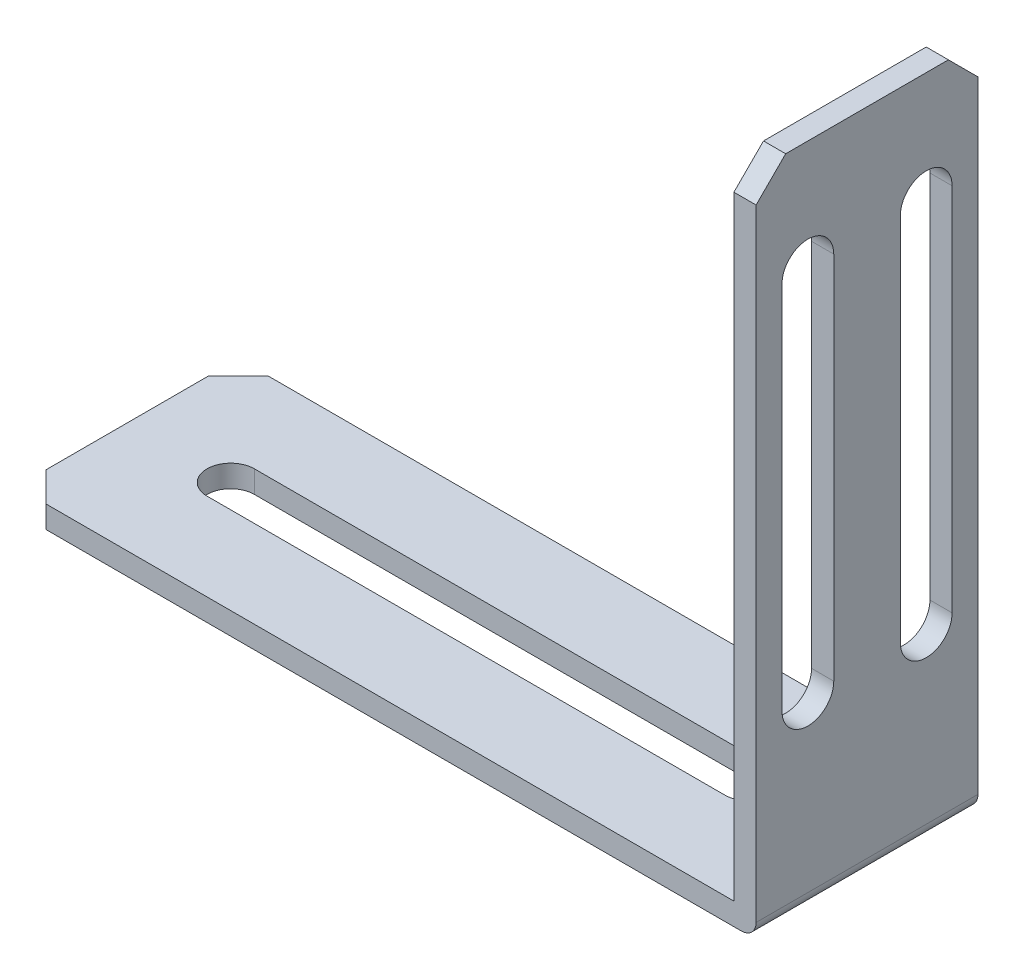
ISO-10303-21;
HEADER;
FILE_DESCRIPTION(('STEP AP214'),'2;1');
FILE_NAME('part.step','',(''),(''),'','','');
FILE_SCHEMA(('AUTOMOTIVE_DESIGN { 1 0 10303 214 1 1 1 1 }'));
ENDSEC;
DATA;
#1=APPLICATION_CONTEXT('core data for automotive mechanical design processes');
#2=APPLICATION_PROTOCOL_DEFINITION('international standard','automotive_design',2000,#1);
#3=PRODUCT_CONTEXT('',#1,'mechanical');
#4=PRODUCT('Part','Part','',(#3));
#5=PRODUCT_RELATED_PRODUCT_CATEGORY('part','',(#4));
#6=PRODUCT_DEFINITION_FORMATION('','',#4);
#7=PRODUCT_DEFINITION_CONTEXT('part definition',#1,'design');
#8=PRODUCT_DEFINITION('design','',#6,#7);
#9=PRODUCT_DEFINITION_SHAPE('','',#8);
#10=(LENGTH_UNIT() NAMED_UNIT(*) SI_UNIT(.MILLI.,.METRE.));
#11=(NAMED_UNIT(*) PLANE_ANGLE_UNIT() SI_UNIT($,.RADIAN.));
#12=(NAMED_UNIT(*) SI_UNIT($,.STERADIAN.) SOLID_ANGLE_UNIT());
#13=UNCERTAINTY_MEASURE_WITH_UNIT(LENGTH_MEASURE(1.E-05),#10,'distance_accuracy_value','');
#14=(GEOMETRIC_REPRESENTATION_CONTEXT(3) GLOBAL_UNCERTAINTY_ASSIGNED_CONTEXT((#13)) GLOBAL_UNIT_ASSIGNED_CONTEXT((#10,
#11,#12)) REPRESENTATION_CONTEXT('',''));
#15=CARTESIAN_POINT('',(0.,0.,0.));
#16=DIRECTION('',(0.,0.,1.));
#17=DIRECTION('',(1.,0.,0.));
#18=AXIS2_PLACEMENT_3D('',#15,#16,#17);
#19=CARTESIAN_POINT('',(-218.840579710145,-1.5,15.));
#20=DIRECTION('',(1.,0.,0.));
#21=DIRECTION('',(0.,0.,-1.));
#22=AXIS2_PLACEMENT_3D('',#19,#20,#21);
#23=PLANE('',#22);
#24=DIRECTION('',(0.,0.,-1.));
#25=VECTOR('',#24,1.);
#26=CARTESIAN_POINT('',(-218.840579710145,-1.5,15.));
#27=LINE('',#26,#25);
#28=CARTESIAN_POINT('',(-218.840579710145,-1.5,13.));
#29=VERTEX_POINT('',#28);
#30=CARTESIAN_POINT('',(-218.840579710145,-1.5,2.00000000000002));
#31=VERTEX_POINT('',#30);
#32=EDGE_CURVE('E325',#29,#31,#27,.T.);
#33=ORIENTED_EDGE('',*,*,#32,.F.);
#34=DIRECTION('',(0.,1.,0.));
#35=VECTOR('',#34,1.);
#36=CARTESIAN_POINT('',(-218.840579710145,-1.5,13.));
#37=LINE('',#36,#35);
#38=CARTESIAN_POINT('',(-218.840579710145,0.,13.));
#39=VERTEX_POINT('',#38);
#40=EDGE_CURVE('E360',#29,#39,#37,.T.);
#41=ORIENTED_EDGE('',*,*,#40,.T.);
#42=DIRECTION('',(0.,0.,-1.));
#43=VECTOR('',#42,1.);
#44=CARTESIAN_POINT('',(-218.840579710145,0.,15.));
#45=LINE('',#44,#43);
#46=CARTESIAN_POINT('',(-218.840579710145,0.,2.00000000000002));
#47=VERTEX_POINT('',#46);
#48=EDGE_CURVE('E306',#39,#47,#45,.T.);
#49=ORIENTED_EDGE('',*,*,#48,.T.);
#50=DIRECTION('',(0.,-1.,0.));
#51=VECTOR('',#50,1.);
#52=CARTESIAN_POINT('',(-218.840579710145,-1.5,2.00000000000002));
#53=LINE('',#52,#51);
#54=EDGE_CURVE('E357',#47,#31,#53,.T.);
#55=ORIENTED_EDGE('',*,*,#54,.T.);
#56=EDGE_LOOP('',(#33,#41,#49,#55));
#57=FACE_BOUND('',#56,.T.);
#58=ADVANCED_FACE('F33',(#57),#23,.F.);
#59=CARTESIAN_POINT('',(-168.840579710145,-1.49999999999999,15.));
#60=DIRECTION('',(0.,1.,0.));
#61=DIRECTION('',(-1.,0.,0.));
#62=AXIS2_PLACEMENT_3D('',#59,#60,#61);
#63=PLANE('',#62);
#64=DIRECTION('',(-1.,0.,0.));
#65=VECTOR('',#64,1.);
#66=CARTESIAN_POINT('',(-176.854809789273,-1.5,5.89999999999999));
#67=LINE('',#66,#65);
#68=CARTESIAN_POINT('',(-176.854809789273,-1.5,5.89999999999999));
#69=VERTEX_POINT('',#68);
#70=CARTESIAN_POINT('',(-211.854809789273,-1.5,5.9));
#71=VERTEX_POINT('',#70);
#72=EDGE_CURVE('E274',#69,#71,#67,.T.);
#73=ORIENTED_EDGE('',*,*,#72,.T.);
#74=CARTESIAN_POINT('',(-211.854809789273,-1.5,7.5));
#75=DIRECTION('',(0.,1.,0.));
#76=DIRECTION('',(0.,0.,1.));
#77=AXIS2_PLACEMENT_3D('',#74,#75,#76);
#78=CIRCLE('',#77,1.6);
#79=CARTESIAN_POINT('',(-211.854809789273,-1.5,9.1));
#80=VERTEX_POINT('',#79);
#81=EDGE_CURVE('E264',#71,#80,#78,.T.);
#82=ORIENTED_EDGE('',*,*,#81,.T.);
#83=DIRECTION('',(1.,0.,0.));
#84=VECTOR('',#83,1.);
#85=CARTESIAN_POINT('',(-176.854809789273,-1.5,9.1));
#86=LINE('',#85,#84);
#87=CARTESIAN_POINT('',(-176.854809789273,-1.5,9.1));
#88=VERTEX_POINT('',#87);
#89=EDGE_CURVE('E267',#80,#88,#86,.T.);
#90=ORIENTED_EDGE('',*,*,#89,.T.);
#91=CARTESIAN_POINT('',(-176.854809789273,-1.5,7.5));
#92=DIRECTION('',(0.,1.,0.));
#93=DIRECTION('',(0.,0.,1.));
#94=AXIS2_PLACEMENT_3D('',#91,#92,#93);
#95=CIRCLE('',#94,1.6);
#96=EDGE_CURVE('E271',#88,#69,#95,.T.);
#97=ORIENTED_EDGE('',*,*,#96,.T.);
#98=EDGE_LOOP('',(#73,#82,#90,#97));
#99=FACE_BOUND('',#98,.T.);
#100=DIRECTION('',(1.,0.,0.));
#101=VECTOR('',#100,1.);
#102=CARTESIAN_POINT('',(-168.840579710145,-1.49999999999999,0.));
#103=LINE('',#102,#101);
#104=CARTESIAN_POINT('',(-216.840579710145,-1.5,0.));
#105=VERTEX_POINT('',#104);
#106=CARTESIAN_POINT('',(-169.840579710145,-1.49999999999999,0.));
#107=VERTEX_POINT('',#106);
#108=EDGE_CURVE('E289',#105,#107,#103,.T.);
#109=ORIENTED_EDGE('',*,*,#108,.T.);
#110=DIRECTION('',(0.,0.,-1.));
#111=VECTOR('',#110,1.);
#112=CARTESIAN_POINT('',(-169.840579710145,-1.49999999999999,15.));
#113=LINE('',#112,#111);
#114=CARTESIAN_POINT('',(-169.840579710145,-1.49999999999999,15.));
#115=VERTEX_POINT('',#114);
#116=EDGE_CURVE('E41',#107,#115,#113,.F.);
#117=ORIENTED_EDGE('',*,*,#116,.T.);
#118=DIRECTION('',(1.,0.,0.));
#119=VECTOR('',#118,1.);
#120=CARTESIAN_POINT('',(-168.840579710145,-1.49999999999999,15.));
#121=LINE('',#120,#119);
#122=CARTESIAN_POINT('',(-216.840579710145,-1.5,15.));
#123=VERTEX_POINT('',#122);
#124=EDGE_CURVE('E296',#123,#115,#121,.T.);
#125=ORIENTED_EDGE('',*,*,#124,.F.);
#126=DIRECTION('',(0.70710678118655,0.,0.707106781186545));
#127=VECTOR('',#126,1.);
#128=CARTESIAN_POINT('',(-216.840579710145,-1.5,15.));
#129=LINE('',#128,#127);
#130=EDGE_CURVE('E355',#123,#29,#129,.F.);
#131=ORIENTED_EDGE('',*,*,#130,.T.);
#132=ORIENTED_EDGE('',*,*,#32,.T.);
#133=DIRECTION('',(0.707106781186549,0.,-0.707106781186546));
#134=VECTOR('',#133,1.);
#135=CARTESIAN_POINT('',(-218.840579710145,-1.5,2.00000000000002));
#136=LINE('',#135,#134);
#137=EDGE_CURVE('E353',#31,#105,#136,.T.);
#138=ORIENTED_EDGE('',*,*,#137,.T.);
#139=EDGE_LOOP('',(#109,#117,#125,#131,#132,#138));
#140=FACE_BOUND('',#139,.T.);
#141=ADVANCED_FACE('F407',(#99,#140),#63,.F.);
#142=CARTESIAN_POINT('',(-168.840579710145,43.5,15.));
#143=DIRECTION('',(-1.,0.,0.));
#144=DIRECTION('',(0.,-1.,0.));
#145=AXIS2_PLACEMENT_3D('',#142,#143,#144);
#146=PLANE('',#145);
#147=DIRECTION('',(0.,-1.,0.));
#148=VECTOR('',#147,1.);
#149=CARTESIAN_POINT('',(-168.840579710145,36.,9.75));
#150=LINE('',#149,#148);
#151=CARTESIAN_POINT('',(-168.840579710145,36.,9.75000000000003));
#152=VERTEX_POINT('',#151);
#153=CARTESIAN_POINT('',(-168.840579710145,11.,9.74999999999999));
#154=VERTEX_POINT('',#153);
#155=EDGE_CURVE('E200',#152,#154,#150,.T.);
#156=ORIENTED_EDGE('',*,*,#155,.T.);
#157=CARTESIAN_POINT('',(-168.840579710145,11.,11.5));
#158=DIRECTION('',(-1.,0.,0.));
#159=DIRECTION('',(0.,-1.,0.));
#160=AXIS2_PLACEMENT_3D('',#157,#158,#159);
#161=CIRCLE('',#160,1.75);
#162=CARTESIAN_POINT('',(-168.840579710145,11.,13.25));
#163=VERTEX_POINT('',#162);
#164=EDGE_CURVE('E192',#154,#163,#161,.T.);
#165=ORIENTED_EDGE('',*,*,#164,.T.);
#166=DIRECTION('',(0.,1.,0.));
#167=VECTOR('',#166,1.);
#168=CARTESIAN_POINT('',(-168.840579710145,36.,13.2499999999999));
#169=LINE('',#168,#167);
#170=CARTESIAN_POINT('',(-168.840579710145,36.,13.2499999999999));
#171=VERTEX_POINT('',#170);
#172=EDGE_CURVE('E204',#163,#171,#169,.T.);
#173=ORIENTED_EDGE('',*,*,#172,.T.);
#174=CARTESIAN_POINT('',(-168.840579710145,36.,11.5));
#175=DIRECTION('',(-1.,0.,0.));
#176=DIRECTION('',(0.,-1.,0.));
#177=AXIS2_PLACEMENT_3D('',#174,#175,#176);
#178=CIRCLE('',#177,1.74999999999997);
#179=EDGE_CURVE('E208',#171,#152,#178,.T.);
#180=ORIENTED_EDGE('',*,*,#179,.T.);
#181=EDGE_LOOP('',(#156,#165,#173,#180));
#182=FACE_BOUND('',#181,.T.);
#183=DIRECTION('',(0.,-1.,0.));
#184=VECTOR('',#183,1.);
#185=CARTESIAN_POINT('',(-168.840579710145,36.,1.75));
#186=LINE('',#185,#184);
#187=CARTESIAN_POINT('',(-168.840579710145,36.,1.75));
#188=VERTEX_POINT('',#187);
#189=CARTESIAN_POINT('',(-168.840579710145,11.,1.75));
#190=VERTEX_POINT('',#189);
#191=EDGE_CURVE('E242',#188,#190,#186,.T.);
#192=ORIENTED_EDGE('',*,*,#191,.T.);
#193=CARTESIAN_POINT('',(-168.840579710145,11.,3.5));
#194=DIRECTION('',(-1.,0.,0.));
#195=DIRECTION('',(0.,-1.,0.));
#196=AXIS2_PLACEMENT_3D('',#193,#194,#195);
#197=CIRCLE('',#196,1.75);
#198=CARTESIAN_POINT('',(-168.840579710145,11.,5.25000000000001));
#199=VERTEX_POINT('',#198);
#200=EDGE_CURVE('E232',#190,#199,#197,.T.);
#201=ORIENTED_EDGE('',*,*,#200,.T.);
#202=DIRECTION('',(0.,1.,0.));
#203=VECTOR('',#202,1.);
#204=CARTESIAN_POINT('',(-168.840579710145,36.,5.25));
#205=LINE('',#204,#203);
#206=CARTESIAN_POINT('',(-168.840579710145,36.,5.25));
#207=VERTEX_POINT('',#206);
#208=EDGE_CURVE('E235',#199,#207,#205,.T.);
#209=ORIENTED_EDGE('',*,*,#208,.T.);
#210=CARTESIAN_POINT('',(-168.840579710145,36.,3.5));
#211=DIRECTION('',(-1.,0.,0.));
#212=DIRECTION('',(0.,-1.,0.));
#213=AXIS2_PLACEMENT_3D('',#210,#211,#212);
#214=CIRCLE('',#213,1.75);
#215=EDGE_CURVE('E239',#207,#188,#214,.T.);
#216=ORIENTED_EDGE('',*,*,#215,.T.);
#217=EDGE_LOOP('',(#192,#201,#209,#216));
#218=FACE_BOUND('',#217,.T.);
#219=DIRECTION('',(0.,1.,0.));
#220=VECTOR('',#219,1.);
#221=CARTESIAN_POINT('',(-168.840579710145,43.5,15.));
#222=LINE('',#221,#220);
#223=CARTESIAN_POINT('',(-168.840579710145,-0.49999999999998,15.));
#224=VERTEX_POINT('',#223);
#225=CARTESIAN_POINT('',(-168.840579710145,41.5,15.));
#226=VERTEX_POINT('',#225);
#227=EDGE_CURVE('E298',#224,#226,#222,.T.);
#228=ORIENTED_EDGE('',*,*,#227,.F.);
#229=DIRECTION('',(0.,0.,-1.));
#230=VECTOR('',#229,1.);
#231=CARTESIAN_POINT('',(-168.840579710145,-0.499999999999994,15.));
#232=LINE('',#231,#230);
#233=CARTESIAN_POINT('',(-168.840579710145,-0.49999999999998,0.));
#234=VERTEX_POINT('',#233);
#235=EDGE_CURVE('E366',#224,#234,#232,.T.);
#236=ORIENTED_EDGE('',*,*,#235,.T.);
#237=DIRECTION('',(0.,1.,0.));
#238=VECTOR('',#237,1.);
#239=CARTESIAN_POINT('',(-168.840579710145,43.5,0.));
#240=LINE('',#239,#238);
#241=CARTESIAN_POINT('',(-168.840579710145,41.5,0.));
#242=VERTEX_POINT('',#241);
#243=EDGE_CURVE('E308',#234,#242,#240,.T.);
#244=ORIENTED_EDGE('',*,*,#243,.T.);
#245=DIRECTION('',(0.,0.707106781186549,0.707106781186546));
#246=VECTOR('',#245,1.);
#247=CARTESIAN_POINT('',(-168.840579710145,43.5,2.00000000000001));
#248=LINE('',#247,#246);
#249=CARTESIAN_POINT('',(-168.840579710145,43.5,2.00000000000001));
#250=VERTEX_POINT('',#249);
#251=EDGE_CURVE('E345',#242,#250,#248,.T.);
#252=ORIENTED_EDGE('',*,*,#251,.T.);
#253=DIRECTION('',(0.,0.,-1.));
#254=VECTOR('',#253,1.);
#255=CARTESIAN_POINT('',(-168.840579710145,43.5,15.));
#256=LINE('',#255,#254);
#257=CARTESIAN_POINT('',(-168.840579710145,43.5,13.));
#258=VERTEX_POINT('',#257);
#259=EDGE_CURVE('E322',#258,#250,#256,.T.);
#260=ORIENTED_EDGE('',*,*,#259,.F.);
#261=DIRECTION('',(0.,0.707106781186546,-0.707106781186549));
#262=VECTOR('',#261,1.);
#263=CARTESIAN_POINT('',(-168.840579710145,41.4999999999999,15.0000000000001));
#264=LINE('',#263,#262);
#265=EDGE_CURVE('E342',#258,#226,#264,.F.);
#266=ORIENTED_EDGE('',*,*,#265,.T.);
#267=EDGE_LOOP('',(#228,#236,#244,#252,#260,#266));
#268=FACE_BOUND('',#267,.T.);
#269=ADVANCED_FACE('F210',(#182,#218,#268),#146,.F.);
#270=CARTESIAN_POINT('',(-170.340579710145,43.5,15.));
#271=DIRECTION('',(0.,-1.,0.));
#272=DIRECTION('',(0.,0.,-1.));
#273=AXIS2_PLACEMENT_3D('',#270,#271,#272);
#274=PLANE('',#273);
#275=ORIENTED_EDGE('',*,*,#259,.T.);
#276=DIRECTION('',(-1.,0.,0.));
#277=VECTOR('',#276,1.);
#278=CARTESIAN_POINT('',(-170.340579710145,43.5,2.00000000000001));
#279=LINE('',#278,#277);
#280=CARTESIAN_POINT('',(-170.340579710145,43.5,2.00000000000001));
#281=VERTEX_POINT('',#280);
#282=EDGE_CURVE('E330',#250,#281,#279,.T.);
#283=ORIENTED_EDGE('',*,*,#282,.T.);
#284=DIRECTION('',(0.,0.,-1.));
#285=VECTOR('',#284,1.);
#286=CARTESIAN_POINT('',(-170.340579710145,43.5,15.));
#287=LINE('',#286,#285);
#288=CARTESIAN_POINT('',(-170.340579710145,43.5,13.));
#289=VERTEX_POINT('',#288);
#290=EDGE_CURVE('E319',#289,#281,#287,.T.);
#291=ORIENTED_EDGE('',*,*,#290,.F.);
#292=DIRECTION('',(1.,0.,0.));
#293=VECTOR('',#292,1.);
#294=CARTESIAN_POINT('',(-170.340579710145,43.5,13.));
#295=LINE('',#294,#293);
#296=EDGE_CURVE('E328',#289,#258,#295,.T.);
#297=ORIENTED_EDGE('',*,*,#296,.T.);
#298=EDGE_LOOP('',(#275,#283,#291,#297));
#299=FACE_BOUND('',#298,.T.);
#300=ADVANCED_FACE('F385',(#299),#274,.F.);
#301=CARTESIAN_POINT('',(-170.340579710145,0.,15.));
#302=DIRECTION('',(1.,0.,0.));
#303=DIRECTION('',(0.,1.,0.));
#304=AXIS2_PLACEMENT_3D('',#301,#302,#303);
#305=PLANE('',#304);
#306=DIRECTION('',(0.,1.,0.));
#307=VECTOR('',#306,1.);
#308=CARTESIAN_POINT('',(-170.340579710145,36.,13.2499999999999));
#309=LINE('',#308,#307);
#310=CARTESIAN_POINT('',(-170.340579710145,11.,13.25));
#311=VERTEX_POINT('',#310);
#312=CARTESIAN_POINT('',(-170.340579710145,36.,13.2499999999999));
#313=VERTEX_POINT('',#312);
#314=EDGE_CURVE('E222',#311,#313,#309,.T.);
#315=ORIENTED_EDGE('',*,*,#314,.F.);
#316=CARTESIAN_POINT('',(-170.340579710145,11.,11.5));
#317=DIRECTION('',(-1.,0.,0.));
#318=DIRECTION('',(0.,-1.,0.));
#319=AXIS2_PLACEMENT_3D('',#316,#317,#318);
#320=CIRCLE('',#319,1.75);
#321=CARTESIAN_POINT('',(-170.340579710145,11.,9.74999999999999));
#322=VERTEX_POINT('',#321);
#323=EDGE_CURVE('E195',#322,#311,#320,.T.);
#324=ORIENTED_EDGE('',*,*,#323,.F.);
#325=DIRECTION('',(0.,-1.,0.));
#326=VECTOR('',#325,1.);
#327=CARTESIAN_POINT('',(-170.340579710145,36.,9.75));
#328=LINE('',#327,#326);
#329=CARTESIAN_POINT('',(-170.340579710145,36.,9.75000000000003));
#330=VERTEX_POINT('',#329);
#331=EDGE_CURVE('E213',#330,#322,#328,.T.);
#332=ORIENTED_EDGE('',*,*,#331,.F.);
#333=CARTESIAN_POINT('',(-170.340579710145,36.,11.5));
#334=DIRECTION('',(-1.,0.,0.));
#335=DIRECTION('',(0.,-1.,0.));
#336=AXIS2_PLACEMENT_3D('',#333,#334,#335);
#337=CIRCLE('',#336,1.74999999999997);
#338=EDGE_CURVE('E216',#313,#330,#337,.T.);
#339=ORIENTED_EDGE('',*,*,#338,.F.);
#340=EDGE_LOOP('',(#315,#324,#332,#339));
#341=FACE_BOUND('',#340,.T.);
#342=DIRECTION('',(0.,1.,0.));
#343=VECTOR('',#342,1.);
#344=CARTESIAN_POINT('',(-170.340579710145,36.,5.25));
#345=LINE('',#344,#343);
#346=CARTESIAN_POINT('',(-170.340579710145,11.,5.25000000000001));
#347=VERTEX_POINT('',#346);
#348=CARTESIAN_POINT('',(-170.340579710145,36.,5.25));
#349=VERTEX_POINT('',#348);
#350=EDGE_CURVE('E247',#347,#349,#345,.T.);
#351=ORIENTED_EDGE('',*,*,#350,.F.);
#352=CARTESIAN_POINT('',(-170.340579710145,11.,3.5));
#353=DIRECTION('',(-1.,0.,0.));
#354=DIRECTION('',(0.,-1.,0.));
#355=AXIS2_PLACEMENT_3D('',#352,#353,#354);
#356=CIRCLE('',#355,1.75);
#357=CARTESIAN_POINT('',(-170.340579710145,11.,1.75));
#358=VERTEX_POINT('',#357);
#359=EDGE_CURVE('E228',#358,#347,#356,.T.);
#360=ORIENTED_EDGE('',*,*,#359,.F.);
#361=DIRECTION('',(0.,-1.,0.));
#362=VECTOR('',#361,1.);
#363=CARTESIAN_POINT('',(-170.340579710145,36.,1.75));
#364=LINE('',#363,#362);
#365=CARTESIAN_POINT('',(-170.340579710145,36.,1.75));
#366=VERTEX_POINT('',#365);
#367=EDGE_CURVE('E236',#366,#358,#364,.T.);
#368=ORIENTED_EDGE('',*,*,#367,.F.);
#369=CARTESIAN_POINT('',(-170.340579710145,36.,3.5));
#370=DIRECTION('',(-1.,0.,0.));
#371=DIRECTION('',(0.,-1.,0.));
#372=AXIS2_PLACEMENT_3D('',#369,#370,#371);
#373=CIRCLE('',#372,1.75);
#374=EDGE_CURVE('E250',#349,#366,#373,.T.);
#375=ORIENTED_EDGE('',*,*,#374,.F.);
#376=EDGE_LOOP('',(#351,#360,#368,#375));
#377=FACE_BOUND('',#376,.T.);
#378=ORIENTED_EDGE('',*,*,#290,.T.);
#379=DIRECTION('',(0.,-0.707106781186549,-0.707106781186546));
#380=VECTOR('',#379,1.);
#381=CARTESIAN_POINT('',(-170.340579710145,43.5,2.00000000000001));
#382=LINE('',#381,#380);
#383=CARTESIAN_POINT('',(-170.340579710145,41.5,0.));
#384=VERTEX_POINT('',#383);
#385=EDGE_CURVE('E335',#281,#384,#382,.T.);
#386=ORIENTED_EDGE('',*,*,#385,.T.);
#387=DIRECTION('',(0.,-1.,0.));
#388=VECTOR('',#387,1.);
#389=CARTESIAN_POINT('',(-170.340579710145,0.,0.));
#390=LINE('',#389,#388);
#391=CARTESIAN_POINT('',(-170.340579710145,0.,0.));
#392=VERTEX_POINT('',#391);
#393=EDGE_CURVE('E310',#384,#392,#390,.T.);
#394=ORIENTED_EDGE('',*,*,#393,.T.);
#395=DIRECTION('',(0.,0.,-1.));
#396=VECTOR('',#395,1.);
#397=CARTESIAN_POINT('',(-170.340579710145,0.,15.));
#398=LINE('',#397,#396);
#399=CARTESIAN_POINT('',(-170.340579710145,0.,15.));
#400=VERTEX_POINT('',#399);
#401=EDGE_CURVE('E316',#400,#392,#398,.T.);
#402=ORIENTED_EDGE('',*,*,#401,.F.);
#403=DIRECTION('',(0.,-1.,0.));
#404=VECTOR('',#403,1.);
#405=CARTESIAN_POINT('',(-170.340579710145,0.,15.));
#406=LINE('',#405,#404);
#407=CARTESIAN_POINT('',(-170.340579710145,41.5,15.));
#408=VERTEX_POINT('',#407);
#409=EDGE_CURVE('E301',#408,#400,#406,.T.);
#410=ORIENTED_EDGE('',*,*,#409,.F.);
#411=DIRECTION('',(0.,-0.707106781186546,0.707106781186549));
#412=VECTOR('',#411,1.);
#413=CARTESIAN_POINT('',(-170.340579710145,41.5,14.9999999999999));
#414=LINE('',#413,#412);
#415=EDGE_CURVE('E333',#408,#289,#414,.F.);
#416=ORIENTED_EDGE('',*,*,#415,.T.);
#417=EDGE_LOOP('',(#378,#386,#394,#402,#410,#416));
#418=FACE_BOUND('',#417,.T.);
#419=ADVANCED_FACE('F396',(#341,#377,#418),#305,.F.);
#420=CARTESIAN_POINT('',(-218.840579710145,0.,15.));
#421=DIRECTION('',(0.,-1.,0.));
#422=DIRECTION('',(0.,0.,-1.));
#423=AXIS2_PLACEMENT_3D('',#420,#421,#422);
#424=PLANE('',#423);
#425=DIRECTION('',(1.,0.,0.));
#426=VECTOR('',#425,1.);
#427=CARTESIAN_POINT('',(-176.854809789273,0.,9.1));
#428=LINE('',#427,#426);
#429=CARTESIAN_POINT('',(-211.854809789273,0.,9.1));
#430=VERTEX_POINT('',#429);
#431=CARTESIAN_POINT('',(-176.854809789273,0.,9.1));
#432=VERTEX_POINT('',#431);
#433=EDGE_CURVE('E279',#430,#432,#428,.T.);
#434=ORIENTED_EDGE('',*,*,#433,.F.);
#435=CARTESIAN_POINT('',(-211.854809789273,0.,7.5));
#436=DIRECTION('',(0.,1.,0.));
#437=DIRECTION('',(0.,0.,1.));
#438=AXIS2_PLACEMENT_3D('',#435,#436,#437);
#439=CIRCLE('',#438,1.6);
#440=CARTESIAN_POINT('',(-211.854809789273,0.,5.9));
#441=VERTEX_POINT('',#440);
#442=EDGE_CURVE('E257',#441,#430,#439,.T.);
#443=ORIENTED_EDGE('',*,*,#442,.F.);
#444=DIRECTION('',(-1.,0.,0.));
#445=VECTOR('',#444,1.);
#446=CARTESIAN_POINT('',(-176.854809789273,0.,5.89999999999999));
#447=LINE('',#446,#445);
#448=CARTESIAN_POINT('',(-176.854809789273,0.,5.89999999999999));
#449=VERTEX_POINT('',#448);
#450=EDGE_CURVE('E268',#449,#441,#447,.T.);
#451=ORIENTED_EDGE('',*,*,#450,.F.);
#452=CARTESIAN_POINT('',(-176.854809789273,0.,7.5));
#453=DIRECTION('',(0.,1.,0.));
#454=DIRECTION('',(0.,0.,1.));
#455=AXIS2_PLACEMENT_3D('',#452,#453,#454);
#456=CIRCLE('',#455,1.6);
#457=EDGE_CURVE('E282',#432,#449,#456,.T.);
#458=ORIENTED_EDGE('',*,*,#457,.F.);
#459=EDGE_LOOP('',(#434,#443,#451,#458));
#460=FACE_BOUND('',#459,.T.);
#461=ORIENTED_EDGE('',*,*,#48,.F.);
#462=DIRECTION('',(-0.70710678118655,0.,-0.707106781186545));
#463=VECTOR('',#462,1.);
#464=CARTESIAN_POINT('',(-216.840579710145,0.,15.));
#465=LINE('',#464,#463);
#466=CARTESIAN_POINT('',(-216.840579710145,0.,15.));
#467=VERTEX_POINT('',#466);
#468=EDGE_CURVE('E364',#39,#467,#465,.F.);
#469=ORIENTED_EDGE('',*,*,#468,.T.);
#470=DIRECTION('',(-1.,0.,0.));
#471=VECTOR('',#470,1.);
#472=CARTESIAN_POINT('',(-218.840579710145,0.,15.));
#473=LINE('',#472,#471);
#474=EDGE_CURVE('E303',#400,#467,#473,.T.);
#475=ORIENTED_EDGE('',*,*,#474,.F.);
#476=ORIENTED_EDGE('',*,*,#401,.T.);
#477=DIRECTION('',(-1.,0.,0.));
#478=VECTOR('',#477,1.);
#479=CARTESIAN_POINT('',(-218.840579710145,0.,0.));
#480=LINE('',#479,#478);
#481=CARTESIAN_POINT('',(-216.840579710145,0.,0.));
#482=VERTEX_POINT('',#481);
#483=EDGE_CURVE('E299',#392,#482,#480,.T.);
#484=ORIENTED_EDGE('',*,*,#483,.T.);
#485=DIRECTION('',(-0.707106781186549,0.,0.707106781186546));
#486=VECTOR('',#485,1.);
#487=CARTESIAN_POINT('',(-218.840579710145,0.,2.00000000000002));
#488=LINE('',#487,#486);
#489=EDGE_CURVE('E362',#482,#47,#488,.T.);
#490=ORIENTED_EDGE('',*,*,#489,.T.);
#491=EDGE_LOOP('',(#461,#469,#475,#476,#484,#490));
#492=FACE_BOUND('',#491,.T.);
#493=ADVANCED_FACE('F400',(#460,#492),#424,.F.);
#494=CARTESIAN_POINT('',(0.,0.,15.));
#495=DIRECTION('',(0.,0.,-1.));
#496=DIRECTION('',(-1.,0.,0.));
#497=AXIS2_PLACEMENT_3D('',#494,#495,#496);
#498=PLANE('',#497);
#499=ORIENTED_EDGE('',*,*,#124,.T.);
#500=CARTESIAN_POINT('',(-169.840579710145,-0.499999999999994,15.));
#501=DIRECTION('',(0.,0.,-1.));
#502=DIRECTION('',(-1.,0.,0.));
#503=AXIS2_PLACEMENT_3D('',#500,#501,#502);
#504=CIRCLE('',#503,1.);
#505=EDGE_CURVE('E11',#115,#224,#504,.F.);
#506=ORIENTED_EDGE('',*,*,#505,.T.);
#507=ORIENTED_EDGE('',*,*,#227,.T.);
#508=DIRECTION('',(-1.,0.,0.));
#509=VECTOR('',#508,1.);
#510=CARTESIAN_POINT('',(0.,41.5,15.));
#511=LINE('',#510,#509);
#512=EDGE_CURVE('E350',#226,#408,#511,.T.);
#513=ORIENTED_EDGE('',*,*,#512,.T.);
#514=ORIENTED_EDGE('',*,*,#409,.T.);
#515=ORIENTED_EDGE('',*,*,#474,.T.);
#516=DIRECTION('',(0.,-1.,0.));
#517=VECTOR('',#516,1.);
#518=CARTESIAN_POINT('',(-216.840579710145,0.,15.));
#519=LINE('',#518,#517);
#520=EDGE_CURVE('E347',#467,#123,#519,.T.);
#521=ORIENTED_EDGE('',*,*,#520,.T.);
#522=EDGE_LOOP('',(#499,#506,#507,#513,#514,#515,#521));
#523=FACE_BOUND('',#522,.T.);
#524=ADVANCED_FACE('F393',(#523),#498,.F.);
#525=CARTESIAN_POINT('',(0.,0.,0.));
#526=DIRECTION('',(0.,0.,-1.));
#527=DIRECTION('',(-1.,0.,0.));
#528=AXIS2_PLACEMENT_3D('',#525,#526,#527);
#529=PLANE('',#528);
#530=ORIENTED_EDGE('',*,*,#243,.F.);
#531=CARTESIAN_POINT('',(-169.840579710145,-0.499999999999994,0.));
#532=DIRECTION('',(0.,0.,-1.));
#533=DIRECTION('',(-1.,0.,0.));
#534=AXIS2_PLACEMENT_3D('',#531,#532,#533);
#535=CIRCLE('',#534,1.);
#536=EDGE_CURVE('E55',#234,#107,#535,.T.);
#537=ORIENTED_EDGE('',*,*,#536,.T.);
#538=ORIENTED_EDGE('',*,*,#108,.F.);
#539=DIRECTION('',(0.,1.,0.));
#540=VECTOR('',#539,1.);
#541=CARTESIAN_POINT('',(-216.840579710145,0.,0.));
#542=LINE('',#541,#540);
#543=EDGE_CURVE('E337',#105,#482,#542,.T.);
#544=ORIENTED_EDGE('',*,*,#543,.T.);
#545=ORIENTED_EDGE('',*,*,#483,.F.);
#546=ORIENTED_EDGE('',*,*,#393,.F.);
#547=DIRECTION('',(1.,0.,0.));
#548=VECTOR('',#547,1.);
#549=CARTESIAN_POINT('',(-168.840579710145,41.5,0.));
#550=LINE('',#549,#548);
#551=EDGE_CURVE('E339',#384,#242,#550,.T.);
#552=ORIENTED_EDGE('',*,*,#551,.T.);
#553=EDGE_LOOP('',(#530,#537,#538,#544,#545,#546,#552));
#554=FACE_BOUND('',#553,.T.);
#555=ADVANCED_FACE('F374',(#554),#529,.T.);
#556=CARTESIAN_POINT('',(-211.854809789273,-1.5,7.5));
#557=DIRECTION('',(0.,1.,0.));
#558=DIRECTION('',(0.,0.,1.));
#559=AXIS2_PLACEMENT_3D('',#556,#557,#558);
#560=CYLINDRICAL_SURFACE('',#559,1.6);
#561=ORIENTED_EDGE('',*,*,#442,.T.);
#562=DIRECTION('',(0.,1.,0.));
#563=VECTOR('',#562,1.);
#564=CARTESIAN_POINT('',(-211.854809789273,-1.5,9.1));
#565=LINE('',#564,#563);
#566=EDGE_CURVE('E277',#80,#430,#565,.T.);
#567=ORIENTED_EDGE('',*,*,#566,.F.);
#568=ORIENTED_EDGE('',*,*,#81,.F.);
#569=DIRECTION('',(0.,1.,0.));
#570=VECTOR('',#569,1.);
#571=CARTESIAN_POINT('',(-211.854809789273,-1.5,5.9));
#572=LINE('',#571,#570);
#573=EDGE_CURVE('E287',#71,#441,#572,.T.);
#574=ORIENTED_EDGE('',*,*,#573,.T.);
#575=EDGE_LOOP('',(#561,#567,#568,#574));
#576=FACE_BOUND('',#575,.T.);
#577=ADVANCED_FACE('F465',(#576),#560,.F.);
#578=CARTESIAN_POINT('',(-176.854809789273,-1.5,5.89999999999999));
#579=DIRECTION('',(0.,0.,-1.));
#580=DIRECTION('',(-1.,0.,0.));
#581=AXIS2_PLACEMENT_3D('',#578,#579,#580);
#582=PLANE('',#581);
#583=ORIENTED_EDGE('',*,*,#450,.T.);
#584=ORIENTED_EDGE('',*,*,#573,.F.);
#585=ORIENTED_EDGE('',*,*,#72,.F.);
#586=DIRECTION('',(0.,1.,0.));
#587=VECTOR('',#586,1.);
#588=CARTESIAN_POINT('',(-176.854809789273,-1.5,5.89999999999999));
#589=LINE('',#588,#587);
#590=EDGE_CURVE('E290',#69,#449,#589,.T.);
#591=ORIENTED_EDGE('',*,*,#590,.T.);
#592=EDGE_LOOP('',(#583,#584,#585,#591));
#593=FACE_BOUND('',#592,.T.);
#594=ADVANCED_FACE('F479',(#593),#582,.F.);
#595=CARTESIAN_POINT('',(-176.854809789273,-1.5,7.5));
#596=DIRECTION('',(0.,1.,0.));
#597=DIRECTION('',(0.,0.,1.));
#598=AXIS2_PLACEMENT_3D('',#595,#596,#597);
#599=CYLINDRICAL_SURFACE('',#598,1.6);
#600=ORIENTED_EDGE('',*,*,#457,.T.);
#601=ORIENTED_EDGE('',*,*,#590,.F.);
#602=ORIENTED_EDGE('',*,*,#96,.F.);
#603=DIRECTION('',(0.,1.,0.));
#604=VECTOR('',#603,1.);
#605=CARTESIAN_POINT('',(-176.854809789273,-1.5,9.1));
#606=LINE('',#605,#604);
#607=EDGE_CURVE('E292',#88,#432,#606,.T.);
#608=ORIENTED_EDGE('',*,*,#607,.T.);
#609=EDGE_LOOP('',(#600,#601,#602,#608));
#610=FACE_BOUND('',#609,.T.);
#611=ADVANCED_FACE('F486',(#610),#599,.F.);
#612=CARTESIAN_POINT('',(-176.854809789273,-1.5,9.1));
#613=DIRECTION('',(0.,0.,1.));
#614=DIRECTION('',(1.,0.,0.));
#615=AXIS2_PLACEMENT_3D('',#612,#613,#614);
#616=PLANE('',#615);
#617=ORIENTED_EDGE('',*,*,#433,.T.);
#618=ORIENTED_EDGE('',*,*,#607,.F.);
#619=ORIENTED_EDGE('',*,*,#89,.F.);
#620=ORIENTED_EDGE('',*,*,#566,.T.);
#621=EDGE_LOOP('',(#617,#618,#619,#620));
#622=FACE_BOUND('',#621,.T.);
#623=ADVANCED_FACE('F494',(#622),#616,.F.);
#624=CARTESIAN_POINT('',(-168.840579710145,11.,3.5));
#625=DIRECTION('',(-1.,0.,0.));
#626=DIRECTION('',(0.,-1.,0.));
#627=AXIS2_PLACEMENT_3D('',#624,#625,#626);
#628=CYLINDRICAL_SURFACE('',#627,1.75);
#629=ORIENTED_EDGE('',*,*,#359,.T.);
#630=DIRECTION('',(-1.,0.,0.));
#631=VECTOR('',#630,1.);
#632=CARTESIAN_POINT('',(-168.840579710145,11.,5.25000000000001));
#633=LINE('',#632,#631);
#634=EDGE_CURVE('E245',#199,#347,#633,.T.);
#635=ORIENTED_EDGE('',*,*,#634,.F.);
#636=ORIENTED_EDGE('',*,*,#200,.F.);
#637=DIRECTION('',(-1.,0.,0.));
#638=VECTOR('',#637,1.);
#639=CARTESIAN_POINT('',(-168.840579710145,11.,1.75));
#640=LINE('',#639,#638);
#641=EDGE_CURVE('E255',#190,#358,#640,.T.);
#642=ORIENTED_EDGE('',*,*,#641,.T.);
#643=EDGE_LOOP('',(#629,#635,#636,#642));
#644=FACE_BOUND('',#643,.T.);
#645=ADVANCED_FACE('F502',(#644),#628,.F.);
#646=CARTESIAN_POINT('',(-168.840579710145,36.,1.75));
#647=DIRECTION('',(0.,0.,-1.));
#648=DIRECTION('',(0.,1.,0.));
#649=AXIS2_PLACEMENT_3D('',#646,#647,#648);
#650=PLANE('',#649);
#651=ORIENTED_EDGE('',*,*,#367,.T.);
#652=ORIENTED_EDGE('',*,*,#641,.F.);
#653=ORIENTED_EDGE('',*,*,#191,.F.);
#654=DIRECTION('',(-1.,0.,0.));
#655=VECTOR('',#654,1.);
#656=CARTESIAN_POINT('',(-168.840579710145,36.,1.75));
#657=LINE('',#656,#655);
#658=EDGE_CURVE('E258',#188,#366,#657,.T.);
#659=ORIENTED_EDGE('',*,*,#658,.T.);
#660=EDGE_LOOP('',(#651,#652,#653,#659));
#661=FACE_BOUND('',#660,.T.);
#662=ADVANCED_FACE('F510',(#661),#650,.F.);
#663=CARTESIAN_POINT('',(-168.840579710145,36.,3.5));
#664=DIRECTION('',(-1.,0.,0.));
#665=DIRECTION('',(0.,-1.,0.));
#666=AXIS2_PLACEMENT_3D('',#663,#664,#665);
#667=CYLINDRICAL_SURFACE('',#666,1.75);
#668=ORIENTED_EDGE('',*,*,#374,.T.);
#669=ORIENTED_EDGE('',*,*,#658,.F.);
#670=ORIENTED_EDGE('',*,*,#215,.F.);
#671=DIRECTION('',(-1.,0.,0.));
#672=VECTOR('',#671,1.);
#673=CARTESIAN_POINT('',(-168.840579710145,36.,5.25));
#674=LINE('',#673,#672);
#675=EDGE_CURVE('E260',#207,#349,#674,.T.);
#676=ORIENTED_EDGE('',*,*,#675,.T.);
#677=EDGE_LOOP('',(#668,#669,#670,#676));
#678=FACE_BOUND('',#677,.T.);
#679=ADVANCED_FACE('F518',(#678),#667,.F.);
#680=CARTESIAN_POINT('',(-168.840579710145,36.,5.25));
#681=DIRECTION('',(0.,0.,1.));
#682=DIRECTION('',(0.,-1.,0.));
#683=AXIS2_PLACEMENT_3D('',#680,#681,#682);
#684=PLANE('',#683);
#685=ORIENTED_EDGE('',*,*,#350,.T.);
#686=ORIENTED_EDGE('',*,*,#675,.F.);
#687=ORIENTED_EDGE('',*,*,#208,.F.);
#688=ORIENTED_EDGE('',*,*,#634,.T.);
#689=EDGE_LOOP('',(#685,#686,#687,#688));
#690=FACE_BOUND('',#689,.T.);
#691=ADVANCED_FACE('F526',(#690),#684,.F.);
#692=CARTESIAN_POINT('',(-168.840579710145,11.,11.5));
#693=DIRECTION('',(-1.,0.,0.));
#694=DIRECTION('',(0.,-1.,0.));
#695=AXIS2_PLACEMENT_3D('',#692,#693,#694);
#696=CYLINDRICAL_SURFACE('',#695,1.75);
#697=ORIENTED_EDGE('',*,*,#323,.T.);
#698=DIRECTION('',(-1.,0.,0.));
#699=VECTOR('',#698,1.);
#700=CARTESIAN_POINT('',(-168.840579710145,11.,13.25));
#701=LINE('',#700,#699);
#702=EDGE_CURVE('E188',#163,#311,#701,.T.);
#703=ORIENTED_EDGE('',*,*,#702,.F.);
#704=ORIENTED_EDGE('',*,*,#164,.F.);
#705=DIRECTION('',(-1.,0.,0.));
#706=VECTOR('',#705,1.);
#707=CARTESIAN_POINT('',(-168.840579710145,11.,9.74999999999999));
#708=LINE('',#707,#706);
#709=EDGE_CURVE('E226',#154,#322,#708,.T.);
#710=ORIENTED_EDGE('',*,*,#709,.T.);
#711=EDGE_LOOP('',(#697,#703,#704,#710));
#712=FACE_BOUND('',#711,.T.);
#713=ADVANCED_FACE('F190',(#712),#696,.F.);
#714=CARTESIAN_POINT('',(-168.840579710145,36.,9.75));
#715=DIRECTION('',(0.,0.,-1.));
#716=DIRECTION('',(0.,1.,0.));
#717=AXIS2_PLACEMENT_3D('',#714,#715,#716);
#718=PLANE('',#717);
#719=ORIENTED_EDGE('',*,*,#331,.T.);
#720=ORIENTED_EDGE('',*,*,#709,.F.);
#721=ORIENTED_EDGE('',*,*,#155,.F.);
#722=DIRECTION('',(-1.,0.,0.));
#723=VECTOR('',#722,1.);
#724=CARTESIAN_POINT('',(-168.840579710145,36.,9.75000000000003));
#725=LINE('',#724,#723);
#726=EDGE_CURVE('E229',#152,#330,#725,.T.);
#727=ORIENTED_EDGE('',*,*,#726,.T.);
#728=EDGE_LOOP('',(#719,#720,#721,#727));
#729=FACE_BOUND('',#728,.T.);
#730=ADVANCED_FACE('F541',(#729),#718,.F.);
#731=CARTESIAN_POINT('',(-168.840579710145,36.,11.5));
#732=DIRECTION('',(-1.,0.,0.));
#733=DIRECTION('',(0.,-1.,0.));
#734=AXIS2_PLACEMENT_3D('',#731,#732,#733);
#735=CYLINDRICAL_SURFACE('',#734,1.74999999999997);
#736=ORIENTED_EDGE('',*,*,#338,.T.);
#737=ORIENTED_EDGE('',*,*,#726,.F.);
#738=ORIENTED_EDGE('',*,*,#179,.F.);
#739=DIRECTION('',(-1.,0.,0.));
#740=VECTOR('',#739,1.);
#741=CARTESIAN_POINT('',(-168.840579710145,36.,13.2499999999999));
#742=LINE('',#741,#740);
#743=EDGE_CURVE('E199',#171,#313,#742,.T.);
#744=ORIENTED_EDGE('',*,*,#743,.T.);
#745=EDGE_LOOP('',(#736,#737,#738,#744));
#746=FACE_BOUND('',#745,.T.);
#747=ADVANCED_FACE('F548',(#746),#735,.F.);
#748=CARTESIAN_POINT('',(-168.840579710145,36.,13.2499999999999));
#749=DIRECTION('',(0.,0.,1.));
#750=DIRECTION('',(0.,-1.,0.));
#751=AXIS2_PLACEMENT_3D('',#748,#749,#750);
#752=PLANE('',#751);
#753=ORIENTED_EDGE('',*,*,#314,.T.);
#754=ORIENTED_EDGE('',*,*,#743,.F.);
#755=ORIENTED_EDGE('',*,*,#172,.F.);
#756=ORIENTED_EDGE('',*,*,#702,.T.);
#757=EDGE_LOOP('',(#753,#754,#755,#756));
#758=FACE_BOUND('',#757,.T.);
#759=ADVANCED_FACE('F205',(#758),#752,.F.);
#760=CARTESIAN_POINT('',(-170.340579710145,43.5,2.00000000000001));
#761=DIRECTION('',(0.,0.707106781186546,-0.707106781186549));
#762=DIRECTION('',(1.,0.,0.));
#763=AXIS2_PLACEMENT_3D('',#760,#761,#762);
#764=PLANE('',#763);
#765=ORIENTED_EDGE('',*,*,#251,.F.);
#766=ORIENTED_EDGE('',*,*,#551,.F.);
#767=ORIENTED_EDGE('',*,*,#385,.F.);
#768=ORIENTED_EDGE('',*,*,#282,.F.);
#769=EDGE_LOOP('',(#765,#766,#767,#768));
#770=FACE_BOUND('',#769,.T.);
#771=ADVANCED_FACE('F381',(#770),#764,.T.);
#772=CARTESIAN_POINT('',(0.,41.5,15.));
#773=DIRECTION('',(0.,-0.707106781186549,-0.707106781186546));
#774=DIRECTION('',(-1.,0.,0.));
#775=AXIS2_PLACEMENT_3D('',#772,#773,#774);
#776=PLANE('',#775);
#777=ORIENTED_EDGE('',*,*,#265,.F.);
#778=ORIENTED_EDGE('',*,*,#296,.F.);
#779=ORIENTED_EDGE('',*,*,#415,.F.);
#780=ORIENTED_EDGE('',*,*,#512,.F.);
#781=EDGE_LOOP('',(#777,#778,#779,#780));
#782=FACE_BOUND('',#781,.T.);
#783=ADVANCED_FACE('F389',(#782),#776,.F.);
#784=CARTESIAN_POINT('',(-216.840579710145,0.,15.));
#785=DIRECTION('',(0.707106781186545,0.,-0.70710678118655));
#786=DIRECTION('',(0.,-1.,0.));
#787=AXIS2_PLACEMENT_3D('',#784,#785,#786);
#788=PLANE('',#787);
#789=ORIENTED_EDGE('',*,*,#468,.F.);
#790=ORIENTED_EDGE('',*,*,#40,.F.);
#791=ORIENTED_EDGE('',*,*,#130,.F.);
#792=ORIENTED_EDGE('',*,*,#520,.F.);
#793=EDGE_LOOP('',(#789,#790,#791,#792));
#794=FACE_BOUND('',#793,.T.);
#795=ADVANCED_FACE('F404',(#794),#788,.F.);
#796=CARTESIAN_POINT('',(-218.840579710145,-1.5,2.00000000000002));
#797=DIRECTION('',(-0.707106781186546,0.,-0.707106781186549));
#798=DIRECTION('',(0.,1.,0.));
#799=AXIS2_PLACEMENT_3D('',#796,#797,#798);
#800=PLANE('',#799);
#801=ORIENTED_EDGE('',*,*,#489,.F.);
#802=ORIENTED_EDGE('',*,*,#543,.F.);
#803=ORIENTED_EDGE('',*,*,#137,.F.);
#804=ORIENTED_EDGE('',*,*,#54,.F.);
#805=EDGE_LOOP('',(#801,#802,#803,#804));
#806=FACE_BOUND('',#805,.T.);
#807=ADVANCED_FACE('F412',(#806),#800,.T.);
#808=CARTESIAN_POINT('',(-169.840579710145,-0.499999999999994,15.));
#809=DIRECTION('',(0.,0.,-1.));
#810=DIRECTION('',(-1.,0.,0.));
#811=AXIS2_PLACEMENT_3D('',#808,#809,#810);
#812=CYLINDRICAL_SURFACE('',#811,1.);
#813=ORIENTED_EDGE('',*,*,#505,.F.);
#814=ORIENTED_EDGE('',*,*,#116,.F.);
#815=ORIENTED_EDGE('',*,*,#536,.F.);
#816=ORIENTED_EDGE('',*,*,#235,.F.);
#817=EDGE_LOOP('',(#813,#814,#815,#816));
#818=FACE_BOUND('',#817,.T.);
#819=ADVANCED_FACE('F35',(#818),#812,.T.);
#820=CLOSED_SHELL('',(#58,#141,#269,#300,#419,#493,#524,#555,#577,#594,#611,#623,#645,#662,#679,
#691,#713,#730,#747,#759,#771,#783,#795,#807,#819));
#821=MANIFOLD_SOLID_BREP('B2',#820);
#822=ADVANCED_BREP_SHAPE_REPRESENTATION('',(#18,#821),#14);
#823=SHAPE_DEFINITION_REPRESENTATION(#9,#822);
ENDSEC;
END-ISO-10303-21;
